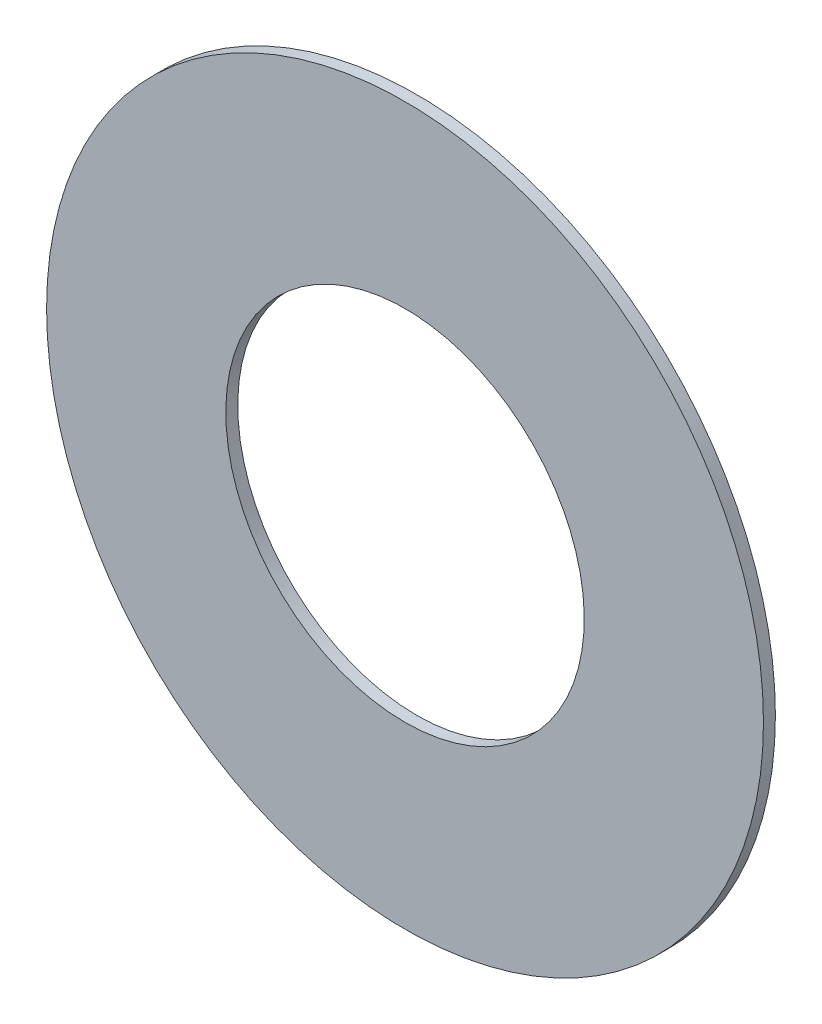
ISO-10303-21;
HEADER;
FILE_DESCRIPTION(('STEP AP214'),'2;1');
FILE_NAME('part.step','',(''),(''),'','','');
FILE_SCHEMA(('AUTOMOTIVE_DESIGN { 1 0 10303 214 1 1 1 1 }'));
ENDSEC;
DATA;
#1=APPLICATION_CONTEXT('core data for automotive mechanical design processes');
#2=APPLICATION_PROTOCOL_DEFINITION('international standard','automotive_design',2000,#1);
#3=PRODUCT_CONTEXT('',#1,'mechanical');
#4=PRODUCT('Part','Part','',(#3));
#5=PRODUCT_RELATED_PRODUCT_CATEGORY('part','',(#4));
#6=PRODUCT_DEFINITION_FORMATION('','',#4);
#7=PRODUCT_DEFINITION_CONTEXT('part definition',#1,'design');
#8=PRODUCT_DEFINITION('design','',#6,#7);
#9=PRODUCT_DEFINITION_SHAPE('','',#8);
#10=(LENGTH_UNIT() NAMED_UNIT(*) SI_UNIT(.MILLI.,.METRE.));
#11=(NAMED_UNIT(*) PLANE_ANGLE_UNIT() SI_UNIT($,.RADIAN.));
#12=(NAMED_UNIT(*) SI_UNIT($,.STERADIAN.) SOLID_ANGLE_UNIT());
#13=UNCERTAINTY_MEASURE_WITH_UNIT(LENGTH_MEASURE(1.E-05),#10,'distance_accuracy_value','');
#14=(GEOMETRIC_REPRESENTATION_CONTEXT(3) GLOBAL_UNCERTAINTY_ASSIGNED_CONTEXT((#13)) GLOBAL_UNIT_ASSIGNED_CONTEXT((#10,
#11,#12)) REPRESENTATION_CONTEXT('',''));
#15=CARTESIAN_POINT('',(0.,0.,0.));
#16=DIRECTION('',(0.,0.,1.));
#17=DIRECTION('',(1.,0.,0.));
#18=AXIS2_PLACEMENT_3D('',#15,#16,#17);
#19=CARTESIAN_POINT('',(131.852,-111.734,-0.045));
#20=DIRECTION('',(0.,0.,-1.));
#21=DIRECTION('',(0.,-1.,0.));
#22=AXIS2_PLACEMENT_3D('',#19,#20,#21);
#23=CYLINDRICAL_SURFACE('',#22,0.525);
#24=CARTESIAN_POINT('',(131.852,-111.734,-0.035));
#25=DIRECTION('',(0.,0.,-1.));
#26=DIRECTION('',(0.,-1.,0.));
#27=AXIS2_PLACEMENT_3D('',#24,#25,#26);
#28=CIRCLE('',#27,0.525);
#29=CARTESIAN_POINT('',(131.852,-112.259,-0.035));
#30=VERTEX_POINT('',#29);
#31=EDGE_CURVE('E25',#30,#30,#28,.T.);
#32=ORIENTED_EDGE('',*,*,#31,.T.);
#33=DIRECTION('',(0.,0.,1.));
#34=VECTOR('',#33,1.);
#35=CARTESIAN_POINT('',(131.852,-112.259,-0.045));
#36=LINE('',#35,#34);
#37=CARTESIAN_POINT('',(131.852,-112.259,0.));
#38=VERTEX_POINT('',#37);
#39=EDGE_CURVE('E11',#30,#38,#36,.T.);
#40=ORIENTED_EDGE('',*,*,#39,.T.);
#41=CARTESIAN_POINT('',(131.852,-111.734,0.));
#42=DIRECTION('',(0.,0.,-1.));
#43=DIRECTION('',(0.,-1.,0.));
#44=AXIS2_PLACEMENT_3D('',#41,#42,#43);
#45=CIRCLE('',#44,0.525);
#46=EDGE_CURVE('E69',#38,#38,#45,.T.);
#47=ORIENTED_EDGE('',*,*,#46,.F.);
#48=ORIENTED_EDGE('',*,*,#39,.F.);
#49=EDGE_LOOP('',(#32,#40,#47,#48));
#50=FACE_BOUND('',#49,.T.);
#51=ADVANCED_FACE('F17',(#50),#23,.F.);
#52=CARTESIAN_POINT('',(131.852,-111.734,-0.035));
#53=DIRECTION('',(0.,0.,1.));
#54=DIRECTION('',(1.,0.,0.));
#55=AXIS2_PLACEMENT_3D('',#52,#53,#54);
#56=PLANE('',#55);
#57=ORIENTED_EDGE('',*,*,#31,.F.);
#58=EDGE_LOOP('',(#57));
#59=FACE_BOUND('',#58,.T.);
#60=CARTESIAN_POINT('',(131.852,-111.734,-0.035));
#61=DIRECTION('',(0.,0.,1.));
#62=DIRECTION('',(1.,0.,0.));
#63=AXIS2_PLACEMENT_3D('',#60,#61,#62);
#64=CIRCLE('',#63,1.05);
#65=CARTESIAN_POINT('',(132.902,-111.734,-0.035));
#66=VERTEX_POINT('',#65);
#67=EDGE_CURVE('E56',#66,#66,#64,.T.);
#68=ORIENTED_EDGE('',*,*,#67,.F.);
#69=EDGE_LOOP('',(#68));
#70=FACE_BOUND('',#69,.T.);
#71=ADVANCED_FACE('F76',(#59,#70),#56,.F.);
#72=CARTESIAN_POINT('',(131.852,-111.734,0.));
#73=DIRECTION('',(0.,0.,1.));
#74=DIRECTION('',(1.,0.,0.));
#75=AXIS2_PLACEMENT_3D('',#72,#73,#74);
#76=PLANE('',#75);
#77=ORIENTED_EDGE('',*,*,#46,.T.);
#78=EDGE_LOOP('',(#77));
#79=FACE_BOUND('',#78,.T.);
#80=CARTESIAN_POINT('',(131.852,-111.734,0.));
#81=DIRECTION('',(0.,0.,1.));
#82=DIRECTION('',(1.,0.,0.));
#83=AXIS2_PLACEMENT_3D('',#80,#81,#82);
#84=CIRCLE('',#83,1.05);
#85=CARTESIAN_POINT('',(132.902,-111.734,0.));
#86=VERTEX_POINT('',#85);
#87=EDGE_CURVE('E54',#86,#86,#84,.T.);
#88=ORIENTED_EDGE('',*,*,#87,.T.);
#89=EDGE_LOOP('',(#88));
#90=FACE_BOUND('',#89,.T.);
#91=ADVANCED_FACE('F60',(#79,#90),#76,.T.);
#92=CARTESIAN_POINT('',(131.852,-111.734,-0.035));
#93=DIRECTION('',(0.,0.,1.));
#94=DIRECTION('',(1.,0.,0.));
#95=AXIS2_PLACEMENT_3D('',#92,#93,#94);
#96=CYLINDRICAL_SURFACE('',#95,1.05);
#97=ORIENTED_EDGE('',*,*,#87,.F.);
#98=DIRECTION('',(0.,0.,1.));
#99=VECTOR('',#98,1.);
#100=CARTESIAN_POINT('',(132.902,-111.734,-0.035));
#101=LINE('',#100,#99);
#102=EDGE_CURVE('E51',#66,#86,#101,.T.);
#103=ORIENTED_EDGE('',*,*,#102,.F.);
#104=ORIENTED_EDGE('',*,*,#67,.T.);
#105=ORIENTED_EDGE('',*,*,#102,.T.);
#106=EDGE_LOOP('',(#97,#103,#104,#105));
#107=FACE_BOUND('',#106,.T.);
#108=ADVANCED_FACE('F53',(#107),#96,.T.);
#109=CLOSED_SHELL('',(#51,#71,#91,#108));
#110=MANIFOLD_SOLID_BREP('B1',#109);
#111=ADVANCED_BREP_SHAPE_REPRESENTATION('',(#18,#110),#14);
#112=SHAPE_DEFINITION_REPRESENTATION(#9,#111);
ENDSEC;
END-ISO-10303-21;
